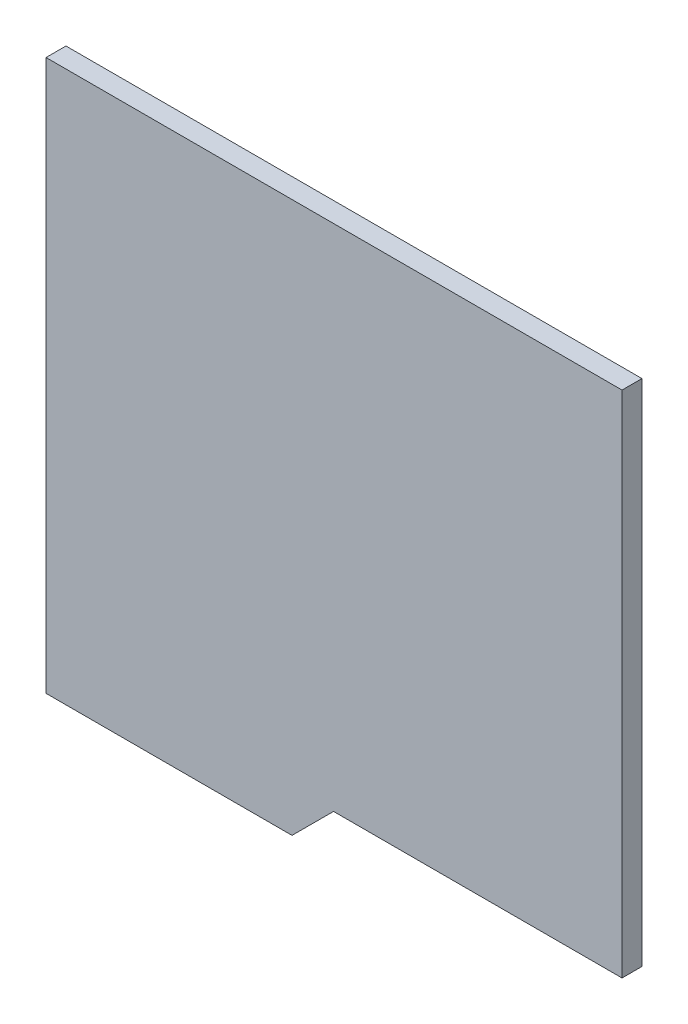
ISO-10303-21;
HEADER;
FILE_DESCRIPTION(('STEP AP214'),'2;1');
FILE_NAME('part.step','',(''),(''),'','','');
FILE_SCHEMA(('AUTOMOTIVE_DESIGN { 1 0 10303 214 1 1 1 1 }'));
ENDSEC;
DATA;
#1=APPLICATION_CONTEXT('core data for automotive mechanical design processes');
#2=APPLICATION_PROTOCOL_DEFINITION('international standard','automotive_design',2000,#1);
#3=PRODUCT_CONTEXT('',#1,'mechanical');
#4=PRODUCT('Part','Part','',(#3));
#5=PRODUCT_RELATED_PRODUCT_CATEGORY('part','',(#4));
#6=PRODUCT_DEFINITION_FORMATION('','',#4);
#7=PRODUCT_DEFINITION_CONTEXT('part definition',#1,'design');
#8=PRODUCT_DEFINITION('design','',#6,#7);
#9=PRODUCT_DEFINITION_SHAPE('','',#8);
#10=(LENGTH_UNIT() NAMED_UNIT(*) SI_UNIT(.MILLI.,.METRE.));
#11=(NAMED_UNIT(*) PLANE_ANGLE_UNIT() SI_UNIT($,.RADIAN.));
#12=(NAMED_UNIT(*) SI_UNIT($,.STERADIAN.) SOLID_ANGLE_UNIT());
#13=UNCERTAINTY_MEASURE_WITH_UNIT(LENGTH_MEASURE(1.E-05),#10,'distance_accuracy_value','');
#14=(GEOMETRIC_REPRESENTATION_CONTEXT(3) GLOBAL_UNCERTAINTY_ASSIGNED_CONTEXT((#13)) GLOBAL_UNIT_ASSIGNED_CONTEXT((#10,
#11,#12)) REPRESENTATION_CONTEXT('',''));
#15=CARTESIAN_POINT('',(0.,0.,0.));
#16=DIRECTION('',(0.,0.,1.));
#17=DIRECTION('',(1.,0.,0.));
#18=AXIS2_PLACEMENT_3D('',#15,#16,#17);
#19=CARTESIAN_POINT('',(-0.0127,-5.8674,0.499999));
#20=DIRECTION('',(0.,0.,1.));
#21=DIRECTION('',(1.,0.,0.));
#22=AXIS2_PLACEMENT_3D('',#19,#20,#21);
#23=PLANE('',#22);
#24=DIRECTION('',(-0.707106781186548,-0.707106781186548,0.));
#25=VECTOR('',#24,1.);
#26=CARTESIAN_POINT('',(-0.0127,-5.8674,0.499999));
#27=LINE('',#26,#25);
#28=CARTESIAN_POINT('',(-0.0127,-5.8674,0.499999));
#29=VERTEX_POINT('',#28);
#30=CARTESIAN_POINT('',(-1.0541,-6.9088,0.499999));
#31=VERTEX_POINT('',#30);
#32=EDGE_CURVE('E150',#29,#31,#27,.T.);
#33=ORIENTED_EDGE('',*,*,#32,.F.);
#34=DIRECTION('',(-1.,0.,0.));
#35=VECTOR('',#34,1.);
#36=CARTESIAN_POINT('',(7.2263,-5.8674,0.499999));
#37=LINE('',#36,#35);
#38=CARTESIAN_POINT('',(7.2263,-5.8674,0.499999));
#39=VERTEX_POINT('',#38);
#40=EDGE_CURVE('E28',#39,#29,#37,.T.);
#41=ORIENTED_EDGE('',*,*,#40,.F.);
#42=DIRECTION('',(0.,-1.,0.));
#43=VECTOR('',#42,1.);
#44=CARTESIAN_POINT('',(7.2263,6.9088,0.499999));
#45=LINE('',#44,#43);
#46=CARTESIAN_POINT('',(7.2263,6.9088,0.499999));
#47=VERTEX_POINT('',#46);
#48=EDGE_CURVE('E93',#47,#39,#45,.T.);
#49=ORIENTED_EDGE('',*,*,#48,.F.);
#50=DIRECTION('',(1.,0.,0.));
#51=VECTOR('',#50,1.);
#52=CARTESIAN_POINT('',(-7.2263,6.9088,0.499999));
#53=LINE('',#52,#51);
#54=CARTESIAN_POINT('',(-7.2263,6.9088,0.499999));
#55=VERTEX_POINT('',#54);
#56=EDGE_CURVE('E87',#55,#47,#53,.T.);
#57=ORIENTED_EDGE('',*,*,#56,.F.);
#58=DIRECTION('',(0.,1.,0.));
#59=VECTOR('',#58,1.);
#60=CARTESIAN_POINT('',(-7.2263,-6.9088,0.499999));
#61=LINE('',#60,#59);
#62=CARTESIAN_POINT('',(-7.2263,-6.9088,0.499999));
#63=VERTEX_POINT('',#62);
#64=EDGE_CURVE('E134',#63,#55,#61,.T.);
#65=ORIENTED_EDGE('',*,*,#64,.F.);
#66=DIRECTION('',(-1.,0.,0.));
#67=VECTOR('',#66,1.);
#68=CARTESIAN_POINT('',(-1.0541,-6.9088,0.499999));
#69=LINE('',#68,#67);
#70=EDGE_CURVE('E21',#31,#63,#69,.T.);
#71=ORIENTED_EDGE('',*,*,#70,.F.);
#72=EDGE_LOOP('',(#33,#41,#49,#57,#65,#71));
#73=FACE_BOUND('',#72,.T.);
#74=ADVANCED_FACE('F17',(#73),#23,.T.);
#75=CARTESIAN_POINT('',(-0.0127,-5.8674,0.));
#76=DIRECTION('',(0.,0.,1.));
#77=DIRECTION('',(1.,0.,0.));
#78=AXIS2_PLACEMENT_3D('',#75,#76,#77);
#79=PLANE('',#78);
#80=DIRECTION('',(-0.707106781186548,-0.707106781186548,0.));
#81=VECTOR('',#80,1.);
#82=CARTESIAN_POINT('',(-0.0127,-5.8674,0.));
#83=LINE('',#82,#81);
#84=CARTESIAN_POINT('',(-0.0127,-5.8674,0.));
#85=VERTEX_POINT('',#84);
#86=CARTESIAN_POINT('',(-1.0541,-6.9088,0.));
#87=VERTEX_POINT('',#86);
#88=EDGE_CURVE('E135',#85,#87,#83,.T.);
#89=ORIENTED_EDGE('',*,*,#88,.T.);
#90=DIRECTION('',(-1.,0.,0.));
#91=VECTOR('',#90,1.);
#92=CARTESIAN_POINT('',(-1.0541,-6.9088,0.));
#93=LINE('',#92,#91);
#94=CARTESIAN_POINT('',(-7.2263,-6.9088,0.));
#95=VERTEX_POINT('',#94);
#96=EDGE_CURVE('E122',#87,#95,#93,.T.);
#97=ORIENTED_EDGE('',*,*,#96,.T.);
#98=DIRECTION('',(0.,1.,0.));
#99=VECTOR('',#98,1.);
#100=CARTESIAN_POINT('',(-7.2263,-6.9088,0.));
#101=LINE('',#100,#99);
#102=CARTESIAN_POINT('',(-7.2263,6.9088,0.));
#103=VERTEX_POINT('',#102);
#104=EDGE_CURVE('E78',#95,#103,#101,.T.);
#105=ORIENTED_EDGE('',*,*,#104,.T.);
#106=DIRECTION('',(1.,0.,0.));
#107=VECTOR('',#106,1.);
#108=CARTESIAN_POINT('',(-7.2263,6.9088,0.));
#109=LINE('',#108,#107);
#110=CARTESIAN_POINT('',(7.2263,6.9088,0.));
#111=VERTEX_POINT('',#110);
#112=EDGE_CURVE('E101',#103,#111,#109,.T.);
#113=ORIENTED_EDGE('',*,*,#112,.T.);
#114=DIRECTION('',(0.,-1.,0.));
#115=VECTOR('',#114,1.);
#116=CARTESIAN_POINT('',(7.2263,6.9088,0.));
#117=LINE('',#116,#115);
#118=CARTESIAN_POINT('',(7.2263,-5.8674,0.));
#119=VERTEX_POINT('',#118);
#120=EDGE_CURVE('E106',#111,#119,#117,.T.);
#121=ORIENTED_EDGE('',*,*,#120,.T.);
#122=DIRECTION('',(-1.,0.,0.));
#123=VECTOR('',#122,1.);
#124=CARTESIAN_POINT('',(7.2263,-5.8674,0.));
#125=LINE('',#124,#123);
#126=EDGE_CURVE('E11',#119,#85,#125,.T.);
#127=ORIENTED_EDGE('',*,*,#126,.T.);
#128=EDGE_LOOP('',(#89,#97,#105,#113,#121,#127));
#129=FACE_BOUND('',#128,.T.);
#130=ADVANCED_FACE('F222',(#129),#79,.F.);
#131=CARTESIAN_POINT('',(7.2263,-5.8674,0.));
#132=DIRECTION('',(0.,-1.,0.));
#133=DIRECTION('',(0.,0.,-1.));
#134=AXIS2_PLACEMENT_3D('',#131,#132,#133);
#135=PLANE('',#134);
#136=DIRECTION('',(0.,0.,1.));
#137=VECTOR('',#136,1.);
#138=CARTESIAN_POINT('',(7.2263,-5.8674,0.));
#139=LINE('',#138,#137);
#140=EDGE_CURVE('E100',#119,#39,#139,.T.);
#141=ORIENTED_EDGE('',*,*,#140,.T.);
#142=ORIENTED_EDGE('',*,*,#40,.T.);
#143=DIRECTION('',(0.,0.,1.));
#144=VECTOR('',#143,1.);
#145=CARTESIAN_POINT('',(-0.0127,-5.8674,0.));
#146=LINE('',#145,#144);
#147=EDGE_CURVE('E164',#85,#29,#146,.T.);
#148=ORIENTED_EDGE('',*,*,#147,.F.);
#149=ORIENTED_EDGE('',*,*,#126,.F.);
#150=EDGE_LOOP('',(#141,#142,#148,#149));
#151=FACE_BOUND('',#150,.T.);
#152=ADVANCED_FACE('F199',(#151),#135,.T.);
#153=CARTESIAN_POINT('',(7.2263,6.9088,0.));
#154=DIRECTION('',(1.,0.,0.));
#155=DIRECTION('',(0.,1.,0.));
#156=AXIS2_PLACEMENT_3D('',#153,#154,#155);
#157=PLANE('',#156);
#158=DIRECTION('',(0.,0.,1.));
#159=VECTOR('',#158,1.);
#160=CARTESIAN_POINT('',(7.2263,6.9088,0.));
#161=LINE('',#160,#159);
#162=EDGE_CURVE('E104',#111,#47,#161,.T.);
#163=ORIENTED_EDGE('',*,*,#162,.T.);
#164=ORIENTED_EDGE('',*,*,#48,.T.);
#165=ORIENTED_EDGE('',*,*,#140,.F.);
#166=ORIENTED_EDGE('',*,*,#120,.F.);
#167=EDGE_LOOP('',(#163,#164,#165,#166));
#168=FACE_BOUND('',#167,.T.);
#169=ADVANCED_FACE('F105',(#168),#157,.T.);
#170=CARTESIAN_POINT('',(-7.2263,6.9088,0.));
#171=DIRECTION('',(0.,1.,0.));
#172=DIRECTION('',(1.,0.,0.));
#173=AXIS2_PLACEMENT_3D('',#170,#171,#172);
#174=PLANE('',#173);
#175=DIRECTION('',(0.,0.,1.));
#176=VECTOR('',#175,1.);
#177=CARTESIAN_POINT('',(-7.2263,6.9088,0.));
#178=LINE('',#177,#176);
#179=EDGE_CURVE('E112',#103,#55,#178,.T.);
#180=ORIENTED_EDGE('',*,*,#179,.T.);
#181=ORIENTED_EDGE('',*,*,#56,.T.);
#182=ORIENTED_EDGE('',*,*,#162,.F.);
#183=ORIENTED_EDGE('',*,*,#112,.F.);
#184=EDGE_LOOP('',(#180,#181,#182,#183));
#185=FACE_BOUND('',#184,.T.);
#186=ADVANCED_FACE('F111',(#185),#174,.T.);
#187=CARTESIAN_POINT('',(-7.2263,-6.9088,0.));
#188=DIRECTION('',(-1.,0.,0.));
#189=DIRECTION('',(0.,0.,1.));
#190=AXIS2_PLACEMENT_3D('',#187,#188,#189);
#191=PLANE('',#190);
#192=DIRECTION('',(0.,0.,1.));
#193=VECTOR('',#192,1.);
#194=CARTESIAN_POINT('',(-7.2263,-6.9088,0.));
#195=LINE('',#194,#193);
#196=EDGE_CURVE('E126',#95,#63,#195,.T.);
#197=ORIENTED_EDGE('',*,*,#196,.T.);
#198=ORIENTED_EDGE('',*,*,#64,.T.);
#199=ORIENTED_EDGE('',*,*,#179,.F.);
#200=ORIENTED_EDGE('',*,*,#104,.F.);
#201=EDGE_LOOP('',(#197,#198,#199,#200));
#202=FACE_BOUND('',#201,.T.);
#203=ADVANCED_FACE('F205',(#202),#191,.T.);
#204=CARTESIAN_POINT('',(-1.0541,-6.9088,0.));
#205=DIRECTION('',(0.,-1.,0.));
#206=DIRECTION('',(0.,0.,-1.));
#207=AXIS2_PLACEMENT_3D('',#204,#205,#206);
#208=PLANE('',#207);
#209=DIRECTION('',(0.,0.,1.));
#210=VECTOR('',#209,1.);
#211=CARTESIAN_POINT('',(-1.0541,-6.9088,0.));
#212=LINE('',#211,#210);
#213=EDGE_CURVE('E142',#87,#31,#212,.T.);
#214=ORIENTED_EDGE('',*,*,#213,.T.);
#215=ORIENTED_EDGE('',*,*,#70,.T.);
#216=ORIENTED_EDGE('',*,*,#196,.F.);
#217=ORIENTED_EDGE('',*,*,#96,.F.);
#218=EDGE_LOOP('',(#214,#215,#216,#217));
#219=FACE_BOUND('',#218,.T.);
#220=ADVANCED_FACE('F210',(#219),#208,.T.);
#221=CARTESIAN_POINT('',(-0.0127,-5.8674,0.));
#222=DIRECTION('',(0.707106781186548,-0.707106781186548,0.));
#223=DIRECTION('',(0.,0.,-1.));
#224=AXIS2_PLACEMENT_3D('',#221,#222,#223);
#225=PLANE('',#224);
#226=ORIENTED_EDGE('',*,*,#147,.T.);
#227=ORIENTED_EDGE('',*,*,#32,.T.);
#228=ORIENTED_EDGE('',*,*,#213,.F.);
#229=ORIENTED_EDGE('',*,*,#88,.F.);
#230=EDGE_LOOP('',(#226,#227,#228,#229));
#231=FACE_BOUND('',#230,.T.);
#232=ADVANCED_FACE('F19',(#231),#225,.T.);
#233=CLOSED_SHELL('',(#74,#130,#152,#169,#186,#203,#220,#232));
#234=MANIFOLD_SOLID_BREP('B1',#233);
#235=ADVANCED_BREP_SHAPE_REPRESENTATION('',(#18,#234),#14);
#236=SHAPE_DEFINITION_REPRESENTATION(#9,#235);
ENDSEC;
END-ISO-10303-21;
